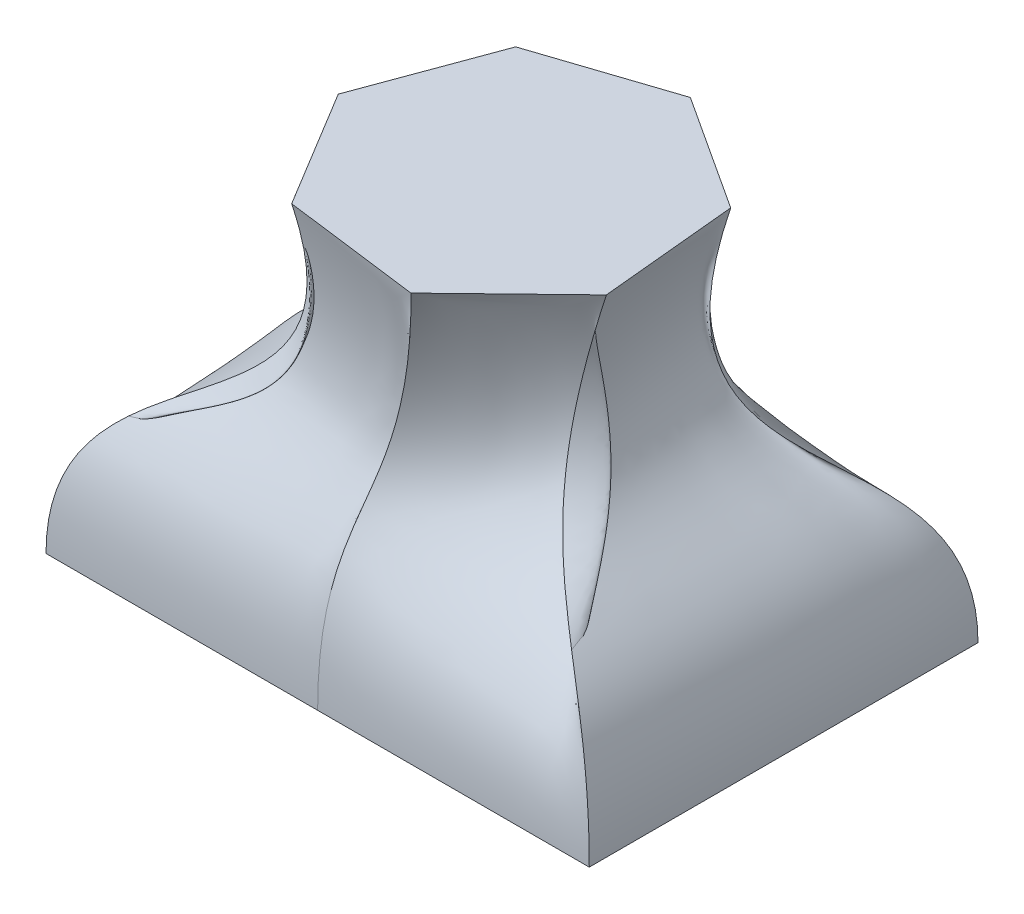
ISO-10303-21;
HEADER;
FILE_DESCRIPTION(('STEP AP214'),'2;1');
FILE_NAME('part.step','',(''),(''),'','','');
FILE_SCHEMA(('AUTOMOTIVE_DESIGN { 1 0 10303 214 1 1 1 1 }'));
ENDSEC;
DATA;
#1=APPLICATION_CONTEXT('core data for automotive mechanical design processes');
#2=APPLICATION_PROTOCOL_DEFINITION('international standard','automotive_design',2000,#1);
#3=PRODUCT_CONTEXT('',#1,'mechanical');
#4=PRODUCT('Part','Part','',(#3));
#5=PRODUCT_RELATED_PRODUCT_CATEGORY('part','',(#4));
#6=PRODUCT_DEFINITION_FORMATION('','',#4);
#7=PRODUCT_DEFINITION_CONTEXT('part definition',#1,'design');
#8=PRODUCT_DEFINITION('design','',#6,#7);
#9=PRODUCT_DEFINITION_SHAPE('','',#8);
#10=(LENGTH_UNIT() NAMED_UNIT(*) SI_UNIT(.MILLI.,.METRE.));
#11=(NAMED_UNIT(*) PLANE_ANGLE_UNIT() SI_UNIT($,.RADIAN.));
#12=(NAMED_UNIT(*) SI_UNIT($,.STERADIAN.) SOLID_ANGLE_UNIT());
#13=UNCERTAINTY_MEASURE_WITH_UNIT(LENGTH_MEASURE(1.E-05),#10,'distance_accuracy_value','');
#14=(GEOMETRIC_REPRESENTATION_CONTEXT(3) GLOBAL_UNCERTAINTY_ASSIGNED_CONTEXT((#13)) GLOBAL_UNIT_ASSIGNED_CONTEXT((#10,
#11,#12)) REPRESENTATION_CONTEXT('',''));
#15=CARTESIAN_POINT('',(0.,0.,0.));
#16=DIRECTION('',(0.,0.,1.));
#17=DIRECTION('',(1.,0.,0.));
#18=AXIS2_PLACEMENT_3D('',#15,#16,#17);
#19=CARTESIAN_POINT('',(0.,100.,0.));
#20=DIRECTION('',(0.,1.,0.));
#21=DIRECTION('',(0.,0.,1.));
#22=AXIS2_PLACEMENT_3D('',#19,#20,#21);
#23=PLANE('',#22);
#24=DIRECTION('',(0.718601585870304,0.,-0.695422001941759));
#25=VECTOR('',#24,1.);
#26=CARTESIAN_POINT('',(13.7392302861292,100.,41.4306061913255));
#27=LINE('',#26,#25);
#28=CARTESIAN_POINT('',(13.7392302861292,100.,41.4306061913255));
#29=VERTEX_POINT('',#28);
#30=CARTESIAN_POINT('',(40.9580222269034,100.,15.0897976625427));
#31=VERTEX_POINT('',#30);
#32=EDGE_CURVE('E512',#29,#31,#27,.T.);
#33=ORIENTED_EDGE('',*,*,#32,.T.);
#34=DIRECTION('',(-0.095662054329363,0.,-0.995413869383728));
#35=VECTOR('',#34,1.);
#36=CARTESIAN_POINT('',(40.9580222269034,100.,15.0897976625427));
#37=LINE('',#36,#35);
#38=CARTESIAN_POINT('',(37.334588039426,100.,-22.6139362819113));
#39=VERTEX_POINT('',#38);
#40=EDGE_CURVE('E522',#31,#39,#37,.T.);
#41=ORIENTED_EDGE('',*,*,#40,.T.);
#42=DIRECTION('',(-0.837890216468732,0.,-0.545838790437233));
#43=VECTOR('',#42,1.);
#44=CARTESIAN_POINT('',(37.334588039426,100.,-22.6139362819113));
#45=LINE('',#44,#43);
#46=CARTESIAN_POINT('',(5.59744757145488,100.,-43.2889149658525));
#47=VERTEX_POINT('',#46);
#48=EDGE_CURVE('E330',#39,#47,#45,.T.);
#49=ORIENTED_EDGE('',*,*,#48,.T.);
#50=DIRECTION('',(-0.949169955761559,0.,0.314764030790686));
#51=VECTOR('',#50,1.);
#52=CARTESIAN_POINT('',(5.59744757145488,100.,-43.2889149658525));
#53=LINE('',#52,#51);
#54=CARTESIAN_POINT('',(-30.3546850849439,100.,-31.3664577475665));
#55=VERTEX_POINT('',#54);
#56=EDGE_CURVE('E550',#47,#55,#53,.T.);
#57=ORIENTED_EDGE('',*,*,#56,.T.);
#58=DIRECTION('',(-0.345705358827343,0.,0.938343116817115));
#59=VECTOR('',#58,1.);
#60=CARTESIAN_POINT('',(-30.3546850849439,100.,-31.3664577475665));
#61=LINE('',#60,#59);
#62=CARTESIAN_POINT('',(-43.4491207496467,100.,4.17558191377124));
#63=VERTEX_POINT('',#62);
#64=EDGE_CURVE('E404',#55,#63,#61,.T.);
#65=ORIENTED_EDGE('',*,*,#64,.T.);
#66=DIRECTION('',(0.518082424408034,0.,0.855330697168933));
#67=VECTOR('',#66,1.);
#68=CARTESIAN_POINT('',(-43.4491207496467,100.,4.17558191377125));
#69=LINE('',#68,#67);
#70=CARTESIAN_POINT('',(-23.8254822893229,100.,36.5733232276908));
#71=VERTEX_POINT('',#70);
#72=EDGE_CURVE('E245',#63,#71,#69,.T.);
#73=ORIENTED_EDGE('',*,*,#72,.T.);
#74=DIRECTION('',(0.991743575108658,0.,0.128236816985986));
#75=VECTOR('',#74,1.);
#76=CARTESIAN_POINT('',(-23.8254822893229,100.,36.5733232276908));
#77=LINE('',#76,#75);
#78=EDGE_CURVE('E12',#71,#29,#77,.T.);
#79=ORIENTED_EDGE('',*,*,#78,.T.);
#80=EDGE_LOOP('',(#33,#41,#49,#57,#65,#73,#79));
#81=FACE_BOUND('',#80,.T.);
#82=ADVANCED_FACE('F235',(#81),#23,.T.);
#83=CARTESIAN_POINT('',(0.,0.,0.));
#84=DIRECTION('',(0.,1.,0.));
#85=DIRECTION('',(0.,0.,1.));
#86=AXIS2_PLACEMENT_3D('',#83,#84,#85);
#87=PLANE('',#86);
#88=DIRECTION('',(0.,0.,-1.));
#89=VECTOR('',#88,1.);
#90=CARTESIAN_POINT('',(74.4572620833549,0.,-53.2783075352006));
#91=LINE('',#90,#89);
#92=CARTESIAN_POINT('',(74.4572620833549,0.,53.2783075352006));
#93=VERTEX_POINT('',#92);
#94=CARTESIAN_POINT('',(74.4572620833549,0.,-53.2783075352006));
#95=VERTEX_POINT('',#94);
#96=EDGE_CURVE('E303',#93,#95,#91,.T.);
#97=ORIENTED_EDGE('',*,*,#96,.F.);
#98=DIRECTION('',(1.,0.,0.));
#99=VECTOR('',#98,1.);
#100=CARTESIAN_POINT('',(-74.4572620833549,0.,53.2783075352006));
#101=LINE('',#100,#99);
#102=CARTESIAN_POINT('',(0.,0.,53.2783075352006));
#103=VERTEX_POINT('',#102);
#104=EDGE_CURVE('E324',#103,#93,#101,.T.);
#105=ORIENTED_EDGE('',*,*,#104,.F.);
#106=CARTESIAN_POINT('',(-74.4572620833549,0.,53.2783075352006));
#107=VERTEX_POINT('',#106);
#108=EDGE_CURVE('E474',#107,#103,#101,.T.);
#109=ORIENTED_EDGE('',*,*,#108,.F.);
#110=DIRECTION('',(0.,0.,1.));
#111=VECTOR('',#110,1.);
#112=CARTESIAN_POINT('',(-74.4572620833549,0.,-53.2783075352006));
#113=LINE('',#112,#111);
#114=CARTESIAN_POINT('',(-74.4572620833549,0.,0.));
#115=VERTEX_POINT('',#114);
#116=EDGE_CURVE('E452',#115,#107,#113,.T.);
#117=ORIENTED_EDGE('',*,*,#116,.F.);
#118=CARTESIAN_POINT('',(-74.4572620833549,0.,-53.2783075352006));
#119=VERTEX_POINT('',#118);
#120=EDGE_CURVE('E595',#119,#115,#113,.T.);
#121=ORIENTED_EDGE('',*,*,#120,.F.);
#122=DIRECTION('',(-1.,0.,0.));
#123=VECTOR('',#122,1.);
#124=CARTESIAN_POINT('',(-74.4572620833549,0.,-53.2783075352006));
#125=LINE('',#124,#123);
#126=CARTESIAN_POINT('',(0.,0.,-53.2783075352006));
#127=VERTEX_POINT('',#126);
#128=EDGE_CURVE('E306',#127,#119,#125,.T.);
#129=ORIENTED_EDGE('',*,*,#128,.F.);
#130=EDGE_CURVE('E298',#95,#127,#125,.T.);
#131=ORIENTED_EDGE('',*,*,#130,.F.);
#132=EDGE_LOOP('',(#97,#105,#109,#117,#121,#129,#131));
#133=FACE_BOUND('',#132,.T.);
#134=ADVANCED_FACE('F301',(#133),#87,.F.);
#135=CARTESIAN_POINT('',(74.4572620833549,0.,-53.2783075352006));
#136=CARTESIAN_POINT('',(74.4572620833549,55.4941361598939,-53.2783075352006));
#137=CARTESIAN_POINT('',(25.5263372622227,29.2409248829776,-4.48767267960749));
#138=CARTESIAN_POINT('',(37.334588039426,100.,-22.6139362819113));
#139=CARTESIAN_POINT('',(68.2524902430753,0.,-53.2783075352006));
#140=CARTESIAN_POINT('',(68.2524902430753,54.7086584813909,-53.2783075352006));
#141=CARTESIAN_POINT('',(28.1928602525935,30.2424662691845,-4.94022447616705));
#142=CARTESIAN_POINT('',(34.6898263337617,100.,-24.3368511722397));
#143=CARTESIAN_POINT('',(58.945332482656,0.,-53.2783075352006));
#144=CARTESIAN_POINT('',(58.945332482656,53.5304419636366,-53.2783075352006));
#145=CARTESIAN_POINT('',(32.1926447381498,31.7447783484948,-5.61905217100641));
#146=CARTESIAN_POINT('',(30.7226837752653,100.,-26.9212235077324));
#147=CARTESIAN_POINT('',(46.5357888020968,0.,-53.2783075352006));
#148=CARTESIAN_POINT('',(46.5357888020968,52.3455976614131,-53.2783075352006));
#149=CARTESIAN_POINT('',(25.1488807861854,33.2555413368842,-10.0418537617827));
#150=CARTESIAN_POINT('',(25.4331603639368,100.,-30.3670532883892));
#151=CARTESIAN_POINT('',(37.2286310416775,0.,-53.2783075352006));
#152=CARTESIAN_POINT('',(37.2286310416775,51.600212011909,-53.2783075352006));
#153=CARTESIAN_POINT('',(21.5717352887205,34.2059624590805,-12.8193370794111));
#154=CARTESIAN_POINT('',(21.4660178054404,100.,-32.9514256238819));
#155=CARTESIAN_POINT('',(27.9214732812581,0.,-53.2783075352006));
#156=CARTESIAN_POINT('',(27.9214732812581,51.0192382174424,-53.2783075352006));
#157=CARTESIAN_POINT('',(17.3602848915751,34.9467464627317,-15.6337235649404));
#158=CARTESIAN_POINT('',(17.498875246944,100.,-35.5357979593745));
#159=CARTESIAN_POINT('',(18.6143155208387,0.,-53.2783075352006));
#160=CARTESIAN_POINT('',(18.6143155208387,50.6083959312637,-53.2783075352006));
#161=CARTESIAN_POINT('',(13.9803766266431,35.470600372363,-18.4615810212887));
#162=CARTESIAN_POINT('',(13.5317326884476,100.,-38.1201702948672));
#163=CARTESIAN_POINT('',(9.30715776041936,0.,-53.2783075352006));
#164=CARTESIAN_POINT('',(9.30715776041936,50.3570132432719,-53.2783075352006));
#165=CARTESIAN_POINT('',(7.90860473253808,35.7911316524872,-20.8071082193785));
#166=CARTESIAN_POINT('',(9.56459012995126,100.,-40.7045426303598));
#167=CARTESIAN_POINT('',(3.10238592013979,0.,-53.2783075352006));
#168=CARTESIAN_POINT('',(3.10238592013979,50.3368250324656,-53.2783075352006));
#169=CARTESIAN_POINT('',(10.4846983927875,35.8168730951653,-23.3805854774099));
#170=CARTESIAN_POINT('',(6.919828424287,100.,-42.4274575206882));
#171=CARTESIAN_POINT('',(0.,0.,-53.2783075352006));
#172=CARTESIAN_POINT('',(0.,50.3267309270624,-53.2783075352006));
#173=CARTESIAN_POINT('',(11.7727452229122,35.8297438165044,-24.6673241064257));
#174=CARTESIAN_POINT('',(5.59744757145488,100.,-43.2889149658525));
#175=B_SPLINE_SURFACE_WITH_KNOTS('',3,3,((#135,#136,#137,#138),(#139,#140,#141,#142),(#143,#144,
#145,#146),(#147,#148,#149,#150),(#151,#152,#153,#154),(#155,#156,#157,#158),(#159,#160,#161,
#162),(#163,#164,#165,#166),(#167,#168,#169,#170),(#171,#172,#173,#174)),.UNSPECIFIED.,.F.,.F.,
.F.,(4,1,1,1,1,1,1,4),(4,4),(0.,0.25,0.375,0.5,0.625,0.75,0.875,1.),(0.,1.),.UNSPECIFIED.);
#176=CARTESIAN_POINT('',(0.,0.,-53.2783075352006));
#177=CARTESIAN_POINT('',(0.,50.3267309270624,-53.2783075352006));
#178=CARTESIAN_POINT('',(11.7727452229122,35.8297438165044,-24.6673241064257));
#179=CARTESIAN_POINT('',(5.59744757145488,100.,-43.2889149658525));
#180=B_SPLINE_CURVE_WITH_KNOTS('',3,(#176,#177,#178,#179),.UNSPECIFIED.,.F.,.F.,(4,4),(0.,1.),.UNSPECIFIED.);
#181=EDGE_CURVE('E332',#127,#47,#180,.T.);
#182=CARTESIAN_POINT('',(74.4572620833549,0.,-53.2783075352006));
#183=CARTESIAN_POINT('',(74.4572620833549,55.4941361598939,-53.2783075352006));
#184=CARTESIAN_POINT('',(25.5263372622227,29.2409248829776,-4.48767267960749));
#185=CARTESIAN_POINT('',(37.334588039426,100.,-22.6139362819113));
#186=B_SPLINE_CURVE_WITH_KNOTS('',3,(#182,#183,#184,#185),.UNSPECIFIED.,.F.,.F.,(4,4),(0.,1.),.UNSPECIFIED.);
#187=EDGE_CURVE('E312',#39,#95,#186,.F.);
#188=ORIENTED_EDGE('',*,*,#130,.T.);
#189=ORIENTED_EDGE('',*,*,#181,.T.);
#190=ORIENTED_EDGE('',*,*,#48,.F.);
#191=ORIENTED_EDGE('',*,*,#187,.T.);
#192=EDGE_LOOP('',(#188,#189,#190,#191));
#193=FACE_BOUND('',#192,.T.);
#194=ADVANCED_FACE('F328',(#193),#175,.T.);
#195=CARTESIAN_POINT('',(0.,0.,-53.2783075352006));
#196=CARTESIAN_POINT('',(0.,50.3267309270624,-53.2783075352006));
#197=CARTESIAN_POINT('',(11.7727452229122,35.8297438165044,-24.6673241064257));
#198=CARTESIAN_POINT('',(5.59744757145488,100.,-43.2889149658525));
#199=CARTESIAN_POINT('',(-6.20477184027958,0.,-53.2783075352006));
#200=CARTESIAN_POINT('',(-6.20477184027958,50.5113342695842,-53.2783075352006));
#201=CARTESIAN_POINT('',(6.00616297075294,35.5943610772772,-23.1576708666707));
#202=CARTESIAN_POINT('',(2.60143651675498,100.,-42.2953768643286));
#203=CARTESIAN_POINT('',(-15.5119296006989,0.,-53.2783075352006));
#204=CARTESIAN_POINT('',(-15.5119296006989,50.788239283367,-53.2783075352006));
#205=CARTESIAN_POINT('',(-2.6437104074859,35.2412869684366,-20.8931910070383));
#206=CARTESIAN_POINT('',(-1.89258006529486,100.,-40.8050697120429));
#207=CARTESIAN_POINT('',(-27.9214732812581,0.,-53.2783075352006));
#208=CARTESIAN_POINT('',(-27.9214732812581,51.4862837179449,-53.2783075352006));
#209=CARTESIAN_POINT('',(-7.76762708904223,34.3512293515561,-18.7513808941993));
#210=CARTESIAN_POINT('',(-7.88460217469465,100.,-38.8179935089952));
#211=CARTESIAN_POINT('',(-37.2286310416775,0.,-53.2783075352006));
#212=CARTESIAN_POINT('',(-37.2286310416775,52.1150782345508,-53.2783075352006));
#213=CARTESIAN_POINT('',(-12.3124151141242,33.5494704358845,-17.0786048163691));
#214=CARTESIAN_POINT('',(-12.3786187567445,100.,-37.3276863567095));
#215=CARTESIAN_POINT('',(-46.5357888020968,0.,-53.2783075352006));
#216=CARTESIAN_POINT('',(-46.5357888020968,52.8592678011371,-53.2783075352006));
#217=CARTESIAN_POINT('',(-17.254424994928,32.6005744067318,-14.9595395290537));
#218=CARTESIAN_POINT('',(-16.8726353387943,100.,-35.8373792044238));
#219=CARTESIAN_POINT('',(-55.8429465625162,0.,-53.2783075352006));
#220=CARTESIAN_POINT('',(-55.8429465625162,53.7124056089564,-53.2783075352006));
#221=CARTESIAN_POINT('',(-19.90569693893,31.5127614159192,-14.4286072172913));
#222=CARTESIAN_POINT('',(-21.3666519208442,100.,-34.347072052138));
#223=CARTESIAN_POINT('',(-65.1501043229355,0.,-53.2783075352006));
#224=CARTESIAN_POINT('',(-65.1501043229355,54.6621058563756,-53.2783075352006));
#225=CARTESIAN_POINT('',(-31.3226987744173,30.3018242647908,-7.73892033997476));
#226=CARTESIAN_POINT('',(-25.860668502894,100.,-32.8567648998523));
#227=CARTESIAN_POINT('',(-71.3548761632151,0.,-53.2783075352006));
#228=CARTESIAN_POINT('',(-71.3548761632151,55.3767788575501,-53.2783075352006));
#229=CARTESIAN_POINT('',(-17.0859122453157,29.3905640114821,-18.4832378141852));
#230=CARTESIAN_POINT('',(-28.8566795575939,100.,-31.8632267983285));
#231=CARTESIAN_POINT('',(-74.4572620833549,0.,-53.2783075352006));
#232=CARTESIAN_POINT('',(-74.4572620833549,55.7341153581373,-53.2783075352006));
#233=CARTESIAN_POINT('',(-9.96751898076484,28.9349338848278,-23.8553965512904));
#234=CARTESIAN_POINT('',(-30.3546850849439,100.,-31.3664577475665));
#235=B_SPLINE_SURFACE_WITH_KNOTS('',3,3,((#195,#196,#197,#198),(#199,#200,#201,#202),(#203,#204,
#205,#206),(#207,#208,#209,#210),(#211,#212,#213,#214),(#215,#216,#217,#218),(#219,#220,#221,
#222),(#223,#224,#225,#226),(#227,#228,#229,#230),(#231,#232,#233,#234)),.UNSPECIFIED.,.F.,.F.,
.F.,(4,1,1,1,1,1,1,4),(4,4),(0.,0.25,0.375,0.5,0.625,0.75,0.875,1.),(0.,1.),.UNSPECIFIED.);
#236=CARTESIAN_POINT('',(-74.4572620833549,0.,-53.2783075352006));
#237=CARTESIAN_POINT('',(-74.4572620833549,55.7341153581373,-53.2783075352006));
#238=CARTESIAN_POINT('',(-9.96751898076484,28.9349338848278,-23.8553965512904));
#239=CARTESIAN_POINT('',(-30.3546850849439,100.,-31.3664577475665));
#240=B_SPLINE_CURVE_WITH_KNOTS('',3,(#236,#237,#238,#239),.UNSPECIFIED.,.F.,.F.,(4,4),(0.,1.),.UNSPECIFIED.);
#241=EDGE_CURVE('E334',#119,#55,#240,.T.);
#242=ORIENTED_EDGE('',*,*,#128,.T.);
#243=ORIENTED_EDGE('',*,*,#241,.T.);
#244=ORIENTED_EDGE('',*,*,#56,.F.);
#245=ORIENTED_EDGE('',*,*,#181,.F.);
#246=EDGE_LOOP('',(#242,#243,#244,#245));
#247=FACE_BOUND('',#246,.T.);
#248=ADVANCED_FACE('F364',(#247),#235,.T.);
#249=CARTESIAN_POINT('',(74.4572620833549,0.,53.2783075352006));
#250=CARTESIAN_POINT('',(74.4572620833549,56.0815507926942,53.2783075352006));
#251=CARTESIAN_POINT('',(19.1960737059639,28.4919283402187,17.1811817247436));
#252=CARTESIAN_POINT('',(40.9580222269034,100.,15.0897976625427));
#253=CARTESIAN_POINT('',(74.4572620833549,0.,44.3985896126672));
#254=CARTESIAN_POINT('',(74.4572620833549,55.2591119917749,44.3985896126672));
#255=CARTESIAN_POINT('',(19.1725792100713,29.5405978559622,13.1042428713076));
#256=CARTESIAN_POINT('',(40.656069377947,100.,11.9478198338382));
#257=CARTESIAN_POINT('',(74.4572620833549,0.,31.079012728867));
#258=CARTESIAN_POINT('',(74.4572620833549,54.0254537903959,31.079012728867));
#259=CARTESIAN_POINT('',(19.1373374662323,31.1136021295776,6.98883459115343));
#260=CARTESIAN_POINT('',(40.2031401045123,100.,7.23485309078143));
#261=CARTESIAN_POINT('',(74.4572620833549,0.,13.3195768838002));
#262=CARTESIAN_POINT('',(74.4572620833549,53.2575858911912,13.3195768838002));
#263=CARTESIAN_POINT('',(18.8270446733077,32.0926897615253,0.975453920262663));
#264=CARTESIAN_POINT('',(39.5992344065994,100.,0.950897433372442));
#265=CARTESIAN_POINT('',(74.4572620833549,0.,0.));
#266=CARTESIAN_POINT('',(74.4572620833549,52.9995731589452,0.));
#267=CARTESIAN_POINT('',(18.5354520500932,32.4216748321199,-3.68192050424673));
#268=CARTESIAN_POINT('',(39.1463051331647,100.,-3.7620693096843));
#269=CARTESIAN_POINT('',(74.4572620833549,0.,-13.3195768838002));
#270=CARTESIAN_POINT('',(74.4572620833549,53.0979366159624,-13.3195768838002));
#271=CARTESIAN_POINT('',(17.8054477408716,32.2962542431085,-8.82018776138154));
#272=CARTESIAN_POINT('',(38.69337585973,100.,-8.47503605274105));
#273=CARTESIAN_POINT('',(74.4572620833549,0.,-26.6391537676003));
#274=CARTESIAN_POINT('',(74.4572620833549,53.548684458101,-26.6391537676003));
#275=CARTESIAN_POINT('',(18.0709685482561,31.7215178362055,-11.8875447666734));
#276=CARTESIAN_POINT('',(38.2404465862953,100.,-13.1880027957978));
#277=CARTESIAN_POINT('',(74.4572620833549,0.,-39.9587306514005));
#278=CARTESIAN_POINT('',(74.4572620833549,54.317836394996,-39.9587306514005));
#279=CARTESIAN_POINT('',(13.9802731678441,30.7407929624578,-22.7576499467116));
#280=CARTESIAN_POINT('',(37.7875173128606,100.,-17.9009695388545));
#281=CARTESIAN_POINT('',(74.4572620833549,0.,-48.8384485739339));
#282=CARTESIAN_POINT('',(74.4572620833549,55.1020362382612,-48.8384485739339));
#283=CARTESIAN_POINT('',(21.6776492307632,29.7408809094709,-10.5776651019755));
#284=CARTESIAN_POINT('',(37.4855644639042,100.,-21.042947367559));
#285=CARTESIAN_POINT('',(74.4572620833549,0.,-53.2783075352006));
#286=CARTESIAN_POINT('',(74.4572620833549,55.4941361598939,-53.2783075352006));
#287=CARTESIAN_POINT('',(25.5263372622227,29.2409248829776,-4.48767267960749));
#288=CARTESIAN_POINT('',(37.334588039426,100.,-22.6139362819113));
#289=B_SPLINE_SURFACE_WITH_KNOTS('',3,3,((#249,#250,#251,#252),(#253,#254,#255,#256),(#257,#258,
#259,#260),(#261,#262,#263,#264),(#265,#266,#267,#268),(#269,#270,#271,#272),(#273,#274,#275,
#276),(#277,#278,#279,#280),(#281,#282,#283,#284),(#285,#286,#287,#288)),.UNSPECIFIED.,.F.,.F.,
.F.,(4,1,1,1,1,1,1,4),(4,4),(0.,0.25,0.375,0.5,0.625,0.75,0.875,1.),(0.,1.),.UNSPECIFIED.);
#290=CARTESIAN_POINT('',(74.4572620833549,0.,53.2783075352006));
#291=CARTESIAN_POINT('',(74.4572620833549,56.0815507926942,53.2783075352006));
#292=CARTESIAN_POINT('',(19.196073705964,28.4919283402187,17.1811817247436));
#293=CARTESIAN_POINT('',(40.9580222269034,100.,15.0897976625427));
#294=B_SPLINE_CURVE_WITH_KNOTS('',3,(#290,#291,#292,#293),.UNSPECIFIED.,.F.,.F.,(4,4),(0.,1.),.UNSPECIFIED.);
#295=EDGE_CURVE('E323',#93,#31,#294,.T.);
#296=ORIENTED_EDGE('',*,*,#96,.T.);
#297=ORIENTED_EDGE('',*,*,#187,.F.);
#298=ORIENTED_EDGE('',*,*,#40,.F.);
#299=ORIENTED_EDGE('',*,*,#295,.F.);
#300=EDGE_LOOP('',(#296,#297,#298,#299));
#301=FACE_BOUND('',#300,.T.);
#302=ADVANCED_FACE('F320',(#301),#289,.T.);
#303=CARTESIAN_POINT('',(-74.4572620833549,0.,-53.2783075352006));
#304=CARTESIAN_POINT('',(-74.4572620833549,55.7341153581373,-53.2783075352006));
#305=CARTESIAN_POINT('',(-9.96751898076486,28.9349338848278,-23.8553965512904));
#306=CARTESIAN_POINT('',(-30.3546850849439,100.,-31.3664577475665));
#307=CARTESIAN_POINT('',(-74.4572620833549,0.,-48.8384485739339));
#308=CARTESIAN_POINT('',(-74.4572620833549,55.3835471979537,-48.8384485739339));
#309=CARTESIAN_POINT('',(-10.5939268292435,29.3819338833249,-24.2739769506153));
#310=CARTESIAN_POINT('',(-31.4458880570024,100.,-28.4046211091217));
#311=CARTESIAN_POINT('',(-74.4572620833549,0.,-42.1786601320338));
#312=CARTESIAN_POINT('',(-74.4572620833549,54.8576949576783,-42.1786601320338));
#313=CARTESIAN_POINT('',(-11.5335386019616,30.0524338810705,-24.9018475496027));
#314=CARTESIAN_POINT('',(-33.0826925150903,100.,-23.9618661514545));
#315=CARTESIAN_POINT('',(-74.4572620833549,0.,-33.2989422095004));
#316=CARTESIAN_POINT('',(-74.4572620833549,54.2375515954047,-33.2989422095004));
#317=CARTESIAN_POINT('',(-14.1490765781873,30.8431619433652,-17.8484385971534));
#318=CARTESIAN_POINT('',(-35.2650984592074,100.,-18.0381928745649));
#319=CARTESIAN_POINT('',(-74.4572620833549,0.,-26.6391537676003));
#320=CARTESIAN_POINT('',(-74.4572620833549,53.8010412810967,-26.6391537676003));
#321=CARTESIAN_POINT('',(-15.9355099679545,31.3997444628317,-13.6969075472853));
#322=CARTESIAN_POINT('',(-36.9019029172953,100.,-13.5954379168977));
#323=CARTESIAN_POINT('',(-74.4572620833549,0.,-19.9793653257002));
#324=CARTESIAN_POINT('',(-74.4572620833549,53.3970847393434,-19.9793653257002));
#325=CARTESIAN_POINT('',(-17.6683934094298,31.9148185456062,-8.93655871509127));
#326=CARTESIAN_POINT('',(-38.5387073753831,100.,-9.15268295923043));
#327=CARTESIAN_POINT('',(-74.4572620833549,0.,-13.3195768838001));
#328=CARTESIAN_POINT('',(-74.4572620833549,53.0263444230483,-13.3195768838001));
#329=CARTESIAN_POINT('',(-19.715838460946,32.3875395158732,-5.47295534773218));
#330=CARTESIAN_POINT('',(-40.175511833471,100.,-4.70992800156321));
#331=CARTESIAN_POINT('',(-74.4572620833549,0.,-6.65978844190008));
#332=CARTESIAN_POINT('',(-74.4572620833549,52.6866009987415,-6.65978844190008));
#333=CARTESIAN_POINT('',(-20.4820185486234,32.8207371858357,2.56881209664075));
#334=CARTESIAN_POINT('',(-41.8123162915588,100.,-0.267173043895981));
#335=CARTESIAN_POINT('',(-74.4572620833549,0.,-2.21992948063336));
#336=CARTESIAN_POINT('',(-74.4572620833549,52.4890131997101,-2.21992948063336));
#337=CARTESIAN_POINT('',(-24.147679941508,33.0726760550809,-3.41395016925756));
#338=CARTESIAN_POINT('',(-42.9035192636174,100.,2.69466359454884));
#339=CARTESIAN_POINT('',(-74.4572620833549,0.,0.));
#340=CARTESIAN_POINT('',(-74.4572620833549,52.3902193001944,0.));
#341=CARTESIAN_POINT('',(-25.9805106379502,33.1986454897036,-6.40533130220672));
#342=CARTESIAN_POINT('',(-43.4491207496467,100.,4.17558191377124));
#343=B_SPLINE_SURFACE_WITH_KNOTS('',3,3,((#303,#304,#305,#306),(#307,#308,#309,#310),(#311,#312,
#313,#314),(#315,#316,#317,#318),(#319,#320,#321,#322),(#323,#324,#325,#326),(#327,#328,#329,
#330),(#331,#332,#333,#334),(#335,#336,#337,#338),(#339,#340,#341,#342)),.UNSPECIFIED.,.F.,.F.,
.F.,(4,1,1,1,1,1,1,4),(4,4),(0.,0.25,0.375,0.5,0.625,0.75,0.875,1.),(0.,1.),.UNSPECIFIED.);
#344=CARTESIAN_POINT('',(-74.4572620833549,0.,0.));
#345=CARTESIAN_POINT('',(-74.4572620833549,52.3902193001944,0.));
#346=CARTESIAN_POINT('',(-25.9805106379502,33.1986454897036,-6.40533130220672));
#347=CARTESIAN_POINT('',(-43.4491207496467,100.,4.17558191377124));
#348=B_SPLINE_CURVE_WITH_KNOTS('',3,(#344,#345,#346,#347),.UNSPECIFIED.,.F.,.F.,(4,4),(0.,1.),.UNSPECIFIED.);
#349=EDGE_CURVE('E435',#115,#63,#348,.T.);
#350=ORIENTED_EDGE('',*,*,#120,.T.);
#351=ORIENTED_EDGE('',*,*,#349,.T.);
#352=ORIENTED_EDGE('',*,*,#64,.F.);
#353=ORIENTED_EDGE('',*,*,#241,.F.);
#354=EDGE_LOOP('',(#350,#351,#352,#353));
#355=FACE_BOUND('',#354,.T.);
#356=ADVANCED_FACE('F408',(#355),#343,.T.);
#357=CARTESIAN_POINT('',(-74.4572620833549,0.,0.));
#358=CARTESIAN_POINT('',(-74.4572620833549,52.3902193001944,0.));
#359=CARTESIAN_POINT('',(-25.9805106379502,33.1986454897036,-6.40533130220671));
#360=CARTESIAN_POINT('',(-43.4491207496467,100.,4.17558191377125));
#361=CARTESIAN_POINT('',(-74.4572620833549,0.,4.43985896126672));
#362=CARTESIAN_POINT('',(-74.4572620833549,52.6193295225369,4.43985896126672));
#363=CARTESIAN_POINT('',(-22.9331284447163,32.906513229349,1.04553259536383));
#364=CARTESIAN_POINT('',(-41.8138175446197,100.,6.87539368993122));
#365=CARTESIAN_POINT('',(-74.4572620833549,0.,11.0996474031668));
#366=CARTESIAN_POINT('',(-74.4572620833549,52.9629948560507,11.0996474031668));
#367=CARTESIAN_POINT('',(-18.3620551548655,32.4683148388172,12.2218284417197));
#368=CARTESIAN_POINT('',(-39.3608627370792,100.,10.9251113541712));
#369=CARTESIAN_POINT('',(-74.4572620833549,0.,19.9793653257002));
#370=CARTESIAN_POINT('',(-74.4572620833549,53.5766071741453,19.9793653257002));
#371=CARTESIAN_POINT('',(-15.2477606824192,31.6859143346687,16.1068267920994));
#372=CARTESIAN_POINT('',(-36.0902563270253,100.,16.3247349064911));
#373=CARTESIAN_POINT('',(-74.4572620833549,0.,26.6391537676003));
#374=CARTESIAN_POINT('',(-74.4572620833549,54.0868172167736,26.6391537676003));
#375=CARTESIAN_POINT('',(-12.6332501531726,31.0353592809281,20.3280242412345));
#376=CARTESIAN_POINT('',(-33.6373015194848,100.,20.3744525707311));
#377=CARTESIAN_POINT('',(-74.4572620833549,0.,33.2989422095004));
#378=CARTESIAN_POINT('',(-74.4572620833549,54.6522182012318,33.2989422095004));
#379=CARTESIAN_POINT('',(-9.51389317390722,30.3144317469766,24.8277916673492));
#380=CARTESIAN_POINT('',(-31.1843467119443,100.,24.424170234971));
#381=CARTESIAN_POINT('',(-74.4572620833549,0.,39.9587306514004));
#382=CARTESIAN_POINT('',(-74.4572620833549,55.2704073741587,39.9587306514004));
#383=CARTESIAN_POINT('',(-8.56658144034381,29.5261954187701,26.9058304991949));
#384=CARTESIAN_POINT('',(-28.7313919044039,100.,28.473887899211));
#385=CARTESIAN_POINT('',(-74.4572620833549,0.,46.6185190933005));
#386=CARTESIAN_POINT('',(-74.4572620833549,55.9358846413735,46.6185190933005));
#387=CARTESIAN_POINT('',(0.686327574135994,28.6776633179397,38.3922137311368));
#388=CARTESIAN_POINT('',(-26.2784370968634,100.,32.5236055634509));
#389=CARTESIAN_POINT('',(-74.4572620833549,0.,51.0583780545672));
#390=CARTESIAN_POINT('',(-74.4572620833549,56.4204095958149,51.0583780545672));
#391=CARTESIAN_POINT('',(-13.7664850611572,28.0598586268529,22.5753698816877));
#392=CARTESIAN_POINT('',(-24.6431338918364,100.,35.2234173396109));
#393=CARTESIAN_POINT('',(-74.4572620833549,0.,53.2783075352006));
#394=CARTESIAN_POINT('',(-74.4572620833549,56.6626720730357,53.2783075352006));
#395=CARTESIAN_POINT('',(-20.9928913788037,27.7509562813095,14.6669479569632));
#396=CARTESIAN_POINT('',(-23.8254822893229,100.,36.5733232276909));
#397=B_SPLINE_SURFACE_WITH_KNOTS('',3,3,((#357,#358,#359,#360),(#361,#362,#363,#364),(#365,#366,
#367,#368),(#369,#370,#371,#372),(#373,#374,#375,#376),(#377,#378,#379,#380),(#381,#382,#383,
#384),(#385,#386,#387,#388),(#389,#390,#391,#392),(#393,#394,#395,#396)),.UNSPECIFIED.,.F.,.F.,
.F.,(4,1,1,1,1,1,1,4),(4,4),(0.,0.25,0.375,0.5,0.625,0.75,0.875,1.),(0.,1.),.UNSPECIFIED.);
#398=CARTESIAN_POINT('',(-74.4572620833549,0.,53.2783075352006));
#399=CARTESIAN_POINT('',(-74.4572620833549,56.6626720730357,53.2783075352006));
#400=CARTESIAN_POINT('',(-20.9928913788037,27.7509562813095,14.6669479569632));
#401=CARTESIAN_POINT('',(-23.8254822893229,100.,36.5733232276909));
#402=B_SPLINE_CURVE_WITH_KNOTS('',3,(#398,#399,#400,#401),.UNSPECIFIED.,.F.,.F.,(4,4),(0.,1.),.UNSPECIFIED.);
#403=EDGE_CURVE('E260',#107,#71,#402,.T.);
#404=ORIENTED_EDGE('',*,*,#116,.T.);
#405=ORIENTED_EDGE('',*,*,#403,.T.);
#406=ORIENTED_EDGE('',*,*,#72,.F.);
#407=ORIENTED_EDGE('',*,*,#349,.F.);
#408=EDGE_LOOP('',(#404,#405,#406,#407));
#409=FACE_BOUND('',#408,.T.);
#410=ADVANCED_FACE('F419',(#409),#397,.T.);
#411=CARTESIAN_POINT('',(-74.4572620833549,0.,53.2783075352006));
#412=CARTESIAN_POINT('',(-74.4572620833549,56.6626720730357,53.2783075352006));
#413=CARTESIAN_POINT('',(-20.9928913788037,27.7509562813095,14.6669479569632));
#414=CARTESIAN_POINT('',(-23.8254822893229,100.,36.5733232276908));
#415=CARTESIAN_POINT('',(-68.2524902430753,0.,53.2783075352006));
#416=CARTESIAN_POINT('',(-68.2524902430753,55.9735990840423,53.2783075352006));
#417=CARTESIAN_POINT('',(-19.1402486046359,28.6295746500829,15.2600021149622));
#418=CARTESIAN_POINT('',(-20.6950895747019,100.,36.9780968079937));
#419=CARTESIAN_POINT('',(-58.945332482656,0.,53.2783075352006));
#420=CARTESIAN_POINT('',(-58.945332482656,54.9399896005522,53.2783075352006));
#421=CARTESIAN_POINT('',(-16.3612844433841,29.9475022032429,16.1495833519606));
#422=CARTESIAN_POINT('',(-15.9995005027704,100.,37.5852571784481));
#423=CARTESIAN_POINT('',(-46.5357888020968,0.,53.2783075352006));
#424=CARTESIAN_POINT('',(-46.5357888020968,53.7813736201604,53.2783075352006));
#425=CARTESIAN_POINT('',(-9.6540221625275,31.4248221664208,17.4260503557865));
#426=CARTESIAN_POINT('',(-9.73871507352837,100.,38.3948043390538));
#427=CARTESIAN_POINT('',(-37.2286310416775,0.,53.2783075352006));
#428=CARTESIAN_POINT('',(-37.2286310416775,52.9932665160706,53.2783075352006));
#429=CARTESIAN_POINT('',(-5.13173291788996,32.4297162622202,18.3711898344026));
#430=CARTESIAN_POINT('',(-5.04312600159685,100.,39.0019647095082));
#431=CARTESIAN_POINT('',(-27.9214732812581,0.,53.2783075352006));
#432=CARTESIAN_POINT('',(-27.9214732812581,52.2982073607531,53.2783075352006));
#433=CARTESIAN_POINT('',(-0.0778021754934667,33.3159674300943,19.1148524194085));
#434=CARTESIAN_POINT('',(-0.347536929665324,100.,39.6091250799625));
#435=CARTESIAN_POINT('',(-18.6143155208387,0.,53.2783075352006));
#436=CARTESIAN_POINT('',(-18.6143155208387,51.700056386392,53.2783075352006));
#437=CARTESIAN_POINT('',(3.35772004187216,34.0786535921817,20.4622450342623));
#438=CARTESIAN_POINT('',(4.3480521422662,100.,40.2162854504169));
#439=CARTESIAN_POINT('',(-9.30715776041936,0.,53.2783075352006));
#440=CARTESIAN_POINT('',(-9.30715776041936,51.1933342206058,53.2783075352006));
#441=CARTESIAN_POINT('',(12.7352348616023,34.724761348306,19.3731695909367));
#442=CARTESIAN_POINT('',(9.04364121419772,100.,40.8234458208712));
#443=CARTESIAN_POINT('',(-3.10238592013979,0.,53.2783075352006));
#444=CARTESIAN_POINT('',(-3.10238592013979,50.9418945917362,53.2783075352006));
#445=CARTESIAN_POINT('',(4.22053681847069,35.0453652322067,24.5879799012074));
#446=CARTESIAN_POINT('',(12.1740339288187,100.,41.2282194011741));
#447=CARTESIAN_POINT('',(0.,0.,53.2783075352006));
#448=CARTESIAN_POINT('',(0.,50.8161747773014,53.2783075352006));
#449=CARTESIAN_POINT('',(-0.0368122030951259,35.2056671741571,27.1953850563428));
#450=CARTESIAN_POINT('',(13.7392302861292,100.,41.4306061913255));
#451=B_SPLINE_SURFACE_WITH_KNOTS('',3,3,((#411,#412,#413,#414),(#415,#416,#417,#418),(#419,#420,
#421,#422),(#423,#424,#425,#426),(#427,#428,#429,#430),(#431,#432,#433,#434),(#435,#436,#437,
#438),(#439,#440,#441,#442),(#443,#444,#445,#446),(#447,#448,#449,#450)),.UNSPECIFIED.,.F.,.F.,
.F.,(4,1,1,1,1,1,1,4),(4,4),(0.,0.25,0.375,0.5,0.625,0.75,0.875,1.),(0.,1.),.UNSPECIFIED.);
#452=CARTESIAN_POINT('',(0.,0.,53.2783075352006));
#453=CARTESIAN_POINT('',(0.,50.8161747773014,53.2783075352006));
#454=CARTESIAN_POINT('',(-0.0368122030951259,35.2056671741571,27.1953850563428));
#455=CARTESIAN_POINT('',(13.7392302861292,100.,41.4306061913255));
#456=B_SPLINE_CURVE_WITH_KNOTS('',3,(#452,#453,#454,#455),.UNSPECIFIED.,.F.,.F.,(4,4),(0.,1.),.UNSPECIFIED.);
#457=EDGE_CURVE('E462',#103,#29,#456,.T.);
#458=ORIENTED_EDGE('',*,*,#108,.T.);
#459=ORIENTED_EDGE('',*,*,#457,.T.);
#460=ORIENTED_EDGE('',*,*,#78,.F.);
#461=ORIENTED_EDGE('',*,*,#403,.F.);
#462=EDGE_LOOP('',(#458,#459,#460,#461));
#463=FACE_BOUND('',#462,.T.);
#464=ADVANCED_FACE('F480',(#463),#451,.T.);
#465=CARTESIAN_POINT('',(0.,0.,53.2783075352006));
#466=CARTESIAN_POINT('',(0.,50.8161747773014,53.2783075352006));
#467=CARTESIAN_POINT('',(-0.0368122030951259,35.2056671741571,27.1953850563428));
#468=CARTESIAN_POINT('',(13.7392302861292,100.,41.4306061913255));
#469=CARTESIAN_POINT('',(6.20477184027958,0.,53.2783075352006));
#470=CARTESIAN_POINT('',(6.20477184027958,50.760657448747,53.2783075352006));
#471=CARTESIAN_POINT('',(8.41916849848009,35.2764558212704,22.522641502094));
#472=CARTESIAN_POINT('',(16.0074629478604,100.,39.2355388139269));
#473=CARTESIAN_POINT('',(15.5119296006989,0.,53.2783075352006));
#474=CARTESIAN_POINT('',(15.5119296006989,50.6773814559153,53.2783075352006));
#475=CARTESIAN_POINT('',(21.1031395508429,35.3826387919403,15.5135261707209));
#476=CARTESIAN_POINT('',(19.4098119404572,100.,35.9429377478291));
#477=CARTESIAN_POINT('',(27.9214732812581,0.,53.2783075352006));
#478=CARTESIAN_POINT('',(27.9214732812581,51.1719424878165,53.2783075352006));
#479=CARTESIAN_POINT('',(23.6534960630701,34.7520373693787,11.7026430969126));
#480=CARTESIAN_POINT('',(23.9462772639196,100.,31.5528029930319));
#481=CARTESIAN_POINT('',(37.2286310416775,0.,53.2783075352006));
#482=CARTESIAN_POINT('',(37.2286310416775,51.7410857538412,53.2783075352006));
#483=CARTESIAN_POINT('',(27.3229506523376,34.0263381532139,8.17834283127273));
#484=CARTESIAN_POINT('',(27.3486262565163,100.,28.2602019269341));
#485=CARTESIAN_POINT('',(46.5357888020968,0.,53.2783075352006));
#486=CARTESIAN_POINT('',(46.5357888020968,52.5270063821501,53.2783075352006));
#487=CARTESIAN_POINT('',(31.1464588666778,33.0242319736655,4.03965548187896));
#488=CARTESIAN_POINT('',(30.7509752491131,100.,24.9676008608362));
#489=CARTESIAN_POINT('',(55.8429465625162,0.,53.2783075352006));
#490=CARTESIAN_POINT('',(55.8429465625162,53.5171964641838,53.2783075352006));
#491=CARTESIAN_POINT('',(32.5970653756301,31.7616673273239,2.52972706223407));
#492=CARTESIAN_POINT('',(34.1533242417099,100.,21.6749997947384));
#493=CARTESIAN_POINT('',(65.1501043229355,0.,53.2783075352006));
#494=CARTESIAN_POINT('',(65.1501043229355,54.6873834628907,53.2783075352006));
#495=CARTESIAN_POINT('',(43.3852250810614,30.2695934710177,-9.35404466726873));
#496=CARTESIAN_POINT('',(37.5556732343066,100.,18.3823987286405));
#497=CARTESIAN_POINT('',(71.3548761632151,0.,53.2783075352006));
#498=CARTESIAN_POINT('',(71.3548761632151,55.6168283494264,53.2783075352006));
#499=CARTESIAN_POINT('',(27.2591241643298,29.0844833838183,8.33610626073951));
#500=CARTESIAN_POINT('',(39.8239058960378,100.,16.187331351242));
#501=CARTESIAN_POINT('',(74.4572620833549,0.,53.2783075352006));
#502=CARTESIAN_POINT('',(74.4572620833549,56.0815507926942,53.2783075352006));
#503=CARTESIAN_POINT('',(19.196073705964,28.4919283402187,17.1811817247436));
#504=CARTESIAN_POINT('',(40.9580222269034,100.,15.0897976625427));
#505=B_SPLINE_SURFACE_WITH_KNOTS('',3,3,((#465,#466,#467,#468),(#469,#470,#471,#472),(#473,#474,
#475,#476),(#477,#478,#479,#480),(#481,#482,#483,#484),(#485,#486,#487,#488),(#489,#490,#491,
#492),(#493,#494,#495,#496),(#497,#498,#499,#500),(#501,#502,#503,#504)),.UNSPECIFIED.,.F.,.F.,
.F.,(4,1,1,1,1,1,1,4),(4,4),(0.,0.25,0.375,0.5,0.625,0.75,0.875,1.),(0.,1.),.UNSPECIFIED.);
#506=ORIENTED_EDGE('',*,*,#104,.T.);
#507=ORIENTED_EDGE('',*,*,#295,.T.);
#508=ORIENTED_EDGE('',*,*,#32,.F.);
#509=ORIENTED_EDGE('',*,*,#457,.F.);
#510=EDGE_LOOP('',(#506,#507,#508,#509));
#511=FACE_BOUND('',#510,.T.);
#512=ADVANCED_FACE('F490',(#511),#505,.T.);
#513=CLOSED_SHELL('',(#82,#134,#194,#248,#302,#356,#410,#464,#512));
#514=MANIFOLD_SOLID_BREP('B2',#513);
#515=ADVANCED_BREP_SHAPE_REPRESENTATION('',(#18,#514),#14);
#516=SHAPE_DEFINITION_REPRESENTATION(#9,#515);
ENDSEC;
END-ISO-10303-21;
